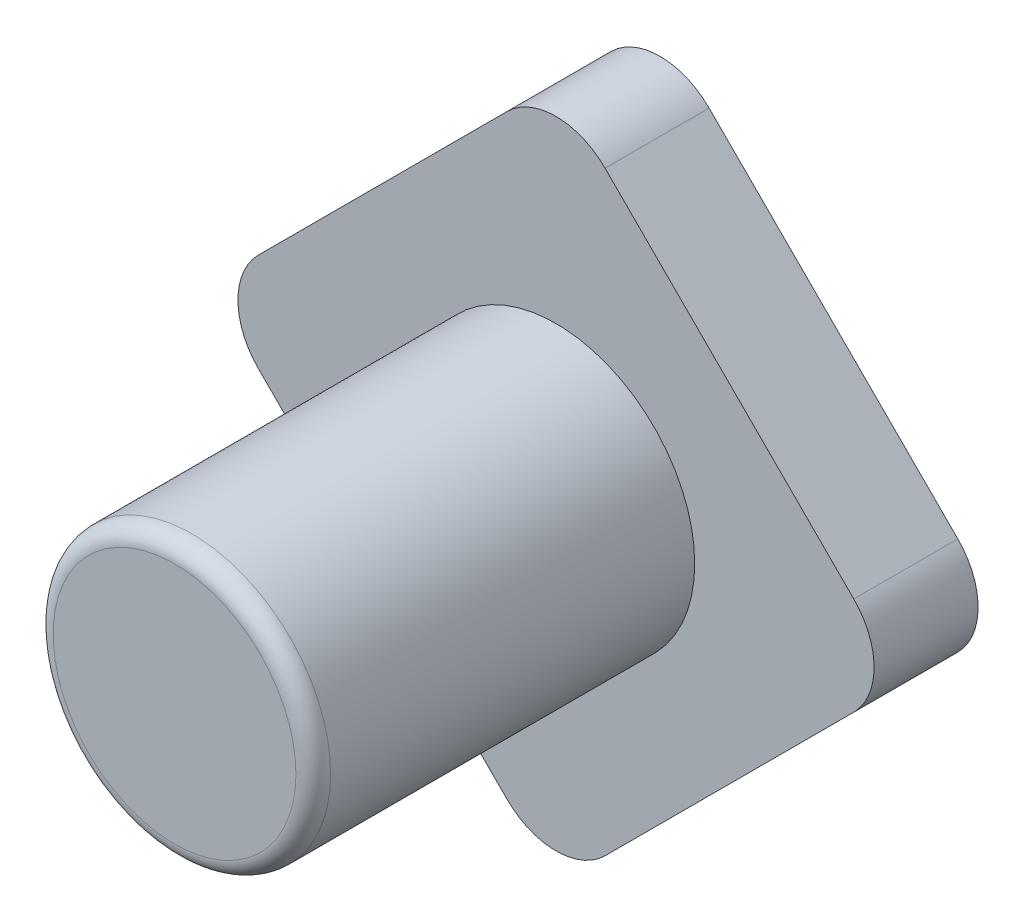
ISO-10303-21;
HEADER;
FILE_DESCRIPTION(('STEP AP214'),'2;1');
FILE_NAME('part.step','',(''),(''),'','','');
FILE_SCHEMA(('AUTOMOTIVE_DESIGN { 1 0 10303 214 1 1 1 1 }'));
ENDSEC;
DATA;
#1=APPLICATION_CONTEXT('core data for automotive mechanical design processes');
#2=APPLICATION_PROTOCOL_DEFINITION('international standard','automotive_design',2000,#1);
#3=PRODUCT_CONTEXT('',#1,'mechanical');
#4=PRODUCT('Part','Part','',(#3));
#5=PRODUCT_RELATED_PRODUCT_CATEGORY('part','',(#4));
#6=PRODUCT_DEFINITION_FORMATION('','',#4);
#7=PRODUCT_DEFINITION_CONTEXT('part definition',#1,'design');
#8=PRODUCT_DEFINITION('design','',#6,#7);
#9=PRODUCT_DEFINITION_SHAPE('','',#8);
#10=(LENGTH_UNIT() NAMED_UNIT(*) SI_UNIT(.MILLI.,.METRE.));
#11=(NAMED_UNIT(*) PLANE_ANGLE_UNIT() SI_UNIT($,.RADIAN.));
#12=(NAMED_UNIT(*) SI_UNIT($,.STERADIAN.) SOLID_ANGLE_UNIT());
#13=UNCERTAINTY_MEASURE_WITH_UNIT(LENGTH_MEASURE(1.E-05),#10,'distance_accuracy_value','');
#14=(GEOMETRIC_REPRESENTATION_CONTEXT(3) GLOBAL_UNCERTAINTY_ASSIGNED_CONTEXT((#13)) GLOBAL_UNIT_ASSIGNED_CONTEXT((#10,
#11,#12)) REPRESENTATION_CONTEXT('',''));
#15=CARTESIAN_POINT('',(0.,0.,0.));
#16=DIRECTION('',(0.,0.,1.));
#17=DIRECTION('',(1.,0.,0.));
#18=AXIS2_PLACEMENT_3D('',#15,#16,#17);
#19=CARTESIAN_POINT('',(-9.99999999999999,0.,-3.));
#20=DIRECTION('',(-0.707106781186548,0.707106781186547,0.));
#21=DIRECTION('',(-0.707106781186547,-0.707106781186548,0.));
#22=AXIS2_PLACEMENT_3D('',#19,#20,#21);
#23=PLANE('',#22);
#24=DIRECTION('',(-0.707106781186547,-0.707106781186548,0.));
#25=VECTOR('',#24,1.);
#26=CARTESIAN_POINT('',(-9.99999999999999,0.,-3.));
#27=LINE('',#26,#25);
#28=CARTESIAN_POINT('',(-1.4142135623731,8.5857864376269,-3.));
#29=VERTEX_POINT('',#28);
#30=CARTESIAN_POINT('',(-8.5857864376269,1.41421356237309,-3.));
#31=VERTEX_POINT('',#30);
#32=EDGE_CURVE('E299',#29,#31,#27,.T.);
#33=ORIENTED_EDGE('',*,*,#32,.T.);
#34=DIRECTION('',(0.,0.,1.));
#35=VECTOR('',#34,1.);
#36=CARTESIAN_POINT('',(-8.5857864376269,1.41421356237309,-3.));
#37=LINE('',#36,#35);
#38=CARTESIAN_POINT('',(-8.5857864376269,1.41421356237309,0.));
#39=VERTEX_POINT('',#38);
#40=EDGE_CURVE('E165',#31,#39,#37,.T.);
#41=ORIENTED_EDGE('',*,*,#40,.T.);
#42=DIRECTION('',(-0.707106781186547,-0.707106781186548,0.));
#43=VECTOR('',#42,1.);
#44=CARTESIAN_POINT('',(-9.99999999999999,0.,0.));
#45=LINE('',#44,#43);
#46=CARTESIAN_POINT('',(-1.4142135623731,8.5857864376269,0.));
#47=VERTEX_POINT('',#46);
#48=EDGE_CURVE('E113',#47,#39,#45,.T.);
#49=ORIENTED_EDGE('',*,*,#48,.F.);
#50=DIRECTION('',(0.,0.,1.));
#51=VECTOR('',#50,1.);
#52=CARTESIAN_POINT('',(-1.4142135623731,8.5857864376269,-3.));
#53=LINE('',#52,#51);
#54=EDGE_CURVE('E163',#47,#29,#53,.F.);
#55=ORIENTED_EDGE('',*,*,#54,.T.);
#56=EDGE_LOOP('',(#33,#41,#49,#55));
#57=FACE_BOUND('',#56,.T.);
#58=ADVANCED_FACE('F41',(#57),#23,.T.);
#59=CARTESIAN_POINT('',(0.,10.,-3.));
#60=DIRECTION('',(0.707106781186547,0.707106781186548,0.));
#61=DIRECTION('',(-0.707106781186548,0.707106781186547,0.));
#62=AXIS2_PLACEMENT_3D('',#59,#60,#61);
#63=PLANE('',#62);
#64=DIRECTION('',(-0.707106781186548,0.707106781186547,0.));
#65=VECTOR('',#64,1.);
#66=CARTESIAN_POINT('',(0.,10.,0.));
#67=LINE('',#66,#65);
#68=CARTESIAN_POINT('',(8.58578643762691,1.41421356237309,0.));
#69=VERTEX_POINT('',#68);
#70=CARTESIAN_POINT('',(1.4142135623731,8.5857864376269,0.));
#71=VERTEX_POINT('',#70);
#72=EDGE_CURVE('E141',#69,#71,#67,.T.);
#73=ORIENTED_EDGE('',*,*,#72,.F.);
#74=DIRECTION('',(0.,0.,1.));
#75=VECTOR('',#74,1.);
#76=CARTESIAN_POINT('',(8.58578643762691,1.4142135623731,-3.));
#77=LINE('',#76,#75);
#78=CARTESIAN_POINT('',(8.58578643762691,1.41421356237309,-3.));
#79=VERTEX_POINT('',#78);
#80=EDGE_CURVE('E63',#69,#79,#77,.F.);
#81=ORIENTED_EDGE('',*,*,#80,.T.);
#82=DIRECTION('',(-0.707106781186548,0.707106781186547,0.));
#83=VECTOR('',#82,1.);
#84=CARTESIAN_POINT('',(0.,10.,-3.));
#85=LINE('',#84,#83);
#86=CARTESIAN_POINT('',(1.4142135623731,8.5857864376269,-3.));
#87=VERTEX_POINT('',#86);
#88=EDGE_CURVE('E138',#79,#87,#85,.T.);
#89=ORIENTED_EDGE('',*,*,#88,.T.);
#90=DIRECTION('',(0.,0.,1.));
#91=VECTOR('',#90,1.);
#92=CARTESIAN_POINT('',(1.4142135623731,8.5857864376269,-3.));
#93=LINE('',#92,#91);
#94=EDGE_CURVE('E159',#87,#71,#93,.T.);
#95=ORIENTED_EDGE('',*,*,#94,.T.);
#96=EDGE_LOOP('',(#73,#81,#89,#95));
#97=FACE_BOUND('',#96,.T.);
#98=ADVANCED_FACE('F181',(#97),#63,.T.);
#99=CARTESIAN_POINT('',(10.,0.,-3.));
#100=DIRECTION('',(0.707106781186547,-0.707106781186548,0.));
#101=DIRECTION('',(0.707106781186548,0.707106781186547,0.));
#102=AXIS2_PLACEMENT_3D('',#99,#100,#101);
#103=PLANE('',#102);
#104=DIRECTION('',(0.707106781186548,0.707106781186547,0.));
#105=VECTOR('',#104,1.);
#106=CARTESIAN_POINT('',(10.,0.,0.));
#107=LINE('',#106,#105);
#108=CARTESIAN_POINT('',(1.4142135623731,-8.5857864376269,0.));
#109=VERTEX_POINT('',#108);
#110=CARTESIAN_POINT('',(8.58578643762691,-1.4142135623731,0.));
#111=VERTEX_POINT('',#110);
#112=EDGE_CURVE('E129',#109,#111,#107,.T.);
#113=ORIENTED_EDGE('',*,*,#112,.F.);
#114=DIRECTION('',(0.,0.,1.));
#115=VECTOR('',#114,1.);
#116=CARTESIAN_POINT('',(1.4142135623731,-8.5857864376269,-3.));
#117=LINE('',#116,#115);
#118=CARTESIAN_POINT('',(1.4142135623731,-8.5857864376269,-3.));
#119=VERTEX_POINT('',#118);
#120=EDGE_CURVE('E151',#109,#119,#117,.F.);
#121=ORIENTED_EDGE('',*,*,#120,.T.);
#122=DIRECTION('',(0.707106781186548,0.707106781186547,0.));
#123=VECTOR('',#122,1.);
#124=CARTESIAN_POINT('',(10.,0.,-3.));
#125=LINE('',#124,#123);
#126=CARTESIAN_POINT('',(8.58578643762691,-1.4142135623731,-3.));
#127=VERTEX_POINT('',#126);
#128=EDGE_CURVE('E298',#119,#127,#125,.T.);
#129=ORIENTED_EDGE('',*,*,#128,.T.);
#130=DIRECTION('',(0.,0.,1.));
#131=VECTOR('',#130,1.);
#132=CARTESIAN_POINT('',(8.58578643762691,-1.4142135623731,-3.));
#133=LINE('',#132,#131);
#134=EDGE_CURVE('E148',#127,#111,#133,.T.);
#135=ORIENTED_EDGE('',*,*,#134,.T.);
#136=EDGE_LOOP('',(#113,#121,#129,#135));
#137=FACE_BOUND('',#136,.T.);
#138=ADVANCED_FACE('F187',(#137),#103,.T.);
#139=CARTESIAN_POINT('',(0.,-10.,-3.));
#140=DIRECTION('',(-0.707106781186548,-0.707106781186547,0.));
#141=DIRECTION('',(0.707106781186547,-0.707106781186548,0.));
#142=AXIS2_PLACEMENT_3D('',#139,#140,#141);
#143=PLANE('',#142);
#144=DIRECTION('',(0.707106781186547,-0.707106781186548,0.));
#145=VECTOR('',#144,1.);
#146=CARTESIAN_POINT('',(0.,-10.,-3.));
#147=LINE('',#146,#145);
#148=CARTESIAN_POINT('',(-8.5857864376269,-1.41421356237309,-3.));
#149=VERTEX_POINT('',#148);
#150=CARTESIAN_POINT('',(-1.4142135623731,-8.5857864376269,-3.));
#151=VERTEX_POINT('',#150);
#152=EDGE_CURVE('E297',#149,#151,#147,.T.);
#153=ORIENTED_EDGE('',*,*,#152,.T.);
#154=DIRECTION('',(0.,0.,1.));
#155=VECTOR('',#154,1.);
#156=CARTESIAN_POINT('',(-1.4142135623731,-8.5857864376269,-3.));
#157=LINE('',#156,#155);
#158=CARTESIAN_POINT('',(-1.4142135623731,-8.5857864376269,0.));
#159=VERTEX_POINT('',#158);
#160=EDGE_CURVE('E128',#151,#159,#157,.T.);
#161=ORIENTED_EDGE('',*,*,#160,.T.);
#162=DIRECTION('',(0.707106781186547,-0.707106781186548,0.));
#163=VECTOR('',#162,1.);
#164=CARTESIAN_POINT('',(0.,-10.,0.));
#165=LINE('',#164,#163);
#166=CARTESIAN_POINT('',(-8.5857864376269,-1.41421356237309,0.));
#167=VERTEX_POINT('',#166);
#168=EDGE_CURVE('E111',#167,#159,#165,.T.);
#169=ORIENTED_EDGE('',*,*,#168,.F.);
#170=DIRECTION('',(0.,0.,1.));
#171=VECTOR('',#170,1.);
#172=CARTESIAN_POINT('',(-8.5857864376269,-1.4142135623731,-3.));
#173=LINE('',#172,#171);
#174=EDGE_CURVE('E125',#167,#149,#173,.F.);
#175=ORIENTED_EDGE('',*,*,#174,.T.);
#176=EDGE_LOOP('',(#153,#161,#169,#175));
#177=FACE_BOUND('',#176,.T.);
#178=ADVANCED_FACE('F124',(#177),#143,.T.);
#179=CARTESIAN_POINT('',(0.,0.,-3.));
#180=DIRECTION('',(0.,0.,-1.));
#181=DIRECTION('',(-1.,0.,0.));
#182=AXIS2_PLACEMENT_3D('',#179,#180,#181);
#183=PLANE('',#182);
#184=ORIENTED_EDGE('',*,*,#128,.F.);
#185=CARTESIAN_POINT('',(0.,-7.17157287525381,-3.));
#186=DIRECTION('',(0.,0.,-1.));
#187=DIRECTION('',(-1.,0.,0.));
#188=AXIS2_PLACEMENT_3D('',#185,#186,#187);
#189=CIRCLE('',#188,2.);
#190=EDGE_CURVE('E157',#119,#151,#189,.T.);
#191=ORIENTED_EDGE('',*,*,#190,.T.);
#192=ORIENTED_EDGE('',*,*,#152,.F.);
#193=CARTESIAN_POINT('',(-7.17157287525381,0.,-3.));
#194=DIRECTION('',(0.,0.,-1.));
#195=DIRECTION('',(-1.,0.,0.));
#196=AXIS2_PLACEMENT_3D('',#193,#194,#195);
#197=CIRCLE('',#196,2.);
#198=EDGE_CURVE('E133',#149,#31,#197,.T.);
#199=ORIENTED_EDGE('',*,*,#198,.T.);
#200=ORIENTED_EDGE('',*,*,#32,.F.);
#201=CARTESIAN_POINT('',(0.,7.17157287525381,-3.));
#202=DIRECTION('',(0.,0.,-1.));
#203=DIRECTION('',(-1.,0.,0.));
#204=AXIS2_PLACEMENT_3D('',#201,#202,#203);
#205=CIRCLE('',#204,2.);
#206=EDGE_CURVE('E56',#29,#87,#205,.T.);
#207=ORIENTED_EDGE('',*,*,#206,.T.);
#208=ORIENTED_EDGE('',*,*,#88,.F.);
#209=CARTESIAN_POINT('',(7.17157287525381,0.,-3.));
#210=DIRECTION('',(0.,0.,-1.));
#211=DIRECTION('',(-1.,0.,0.));
#212=AXIS2_PLACEMENT_3D('',#209,#210,#211);
#213=CIRCLE('',#212,2.);
#214=EDGE_CURVE('E155',#79,#127,#213,.T.);
#215=ORIENTED_EDGE('',*,*,#214,.T.);
#216=EDGE_LOOP('',(#184,#191,#192,#199,#200,#207,#208,#215));
#217=FACE_BOUND('',#216,.T.);
#218=ADVANCED_FACE('F250',(#217),#183,.T.);
#219=CARTESIAN_POINT('',(0.,0.,0.));
#220=DIRECTION('',(0.,0.,-1.));
#221=DIRECTION('',(-1.,0.,0.));
#222=AXIS2_PLACEMENT_3D('',#219,#220,#221);
#223=PLANE('',#222);
#224=CARTESIAN_POINT('',(0.,0.,0.));
#225=DIRECTION('',(0.,0.,1.));
#226=DIRECTION('',(1.,0.,0.));
#227=AXIS2_PLACEMENT_3D('',#224,#225,#226);
#228=CIRCLE('',#227,4.);
#229=CARTESIAN_POINT('',(4.,0.,0.));
#230=VERTEX_POINT('',#229);
#231=EDGE_CURVE('E134',#230,#230,#228,.T.);
#232=ORIENTED_EDGE('',*,*,#231,.F.);
#233=EDGE_LOOP('',(#232));
#234=FACE_BOUND('',#233,.T.);
#235=ORIENTED_EDGE('',*,*,#168,.T.);
#236=CARTESIAN_POINT('',(0.,-7.17157287525381,0.));
#237=DIRECTION('',(0.,0.,-1.));
#238=DIRECTION('',(-1.,0.,0.));
#239=AXIS2_PLACEMENT_3D('',#236,#237,#238);
#240=CIRCLE('',#239,2.);
#241=EDGE_CURVE('E146',#159,#109,#240,.F.);
#242=ORIENTED_EDGE('',*,*,#241,.T.);
#243=ORIENTED_EDGE('',*,*,#112,.T.);
#244=CARTESIAN_POINT('',(7.17157287525381,0.,0.));
#245=DIRECTION('',(0.,0.,-1.));
#246=DIRECTION('',(-1.,0.,0.));
#247=AXIS2_PLACEMENT_3D('',#244,#245,#246);
#248=CIRCLE('',#247,2.);
#249=EDGE_CURVE('E118',#111,#69,#248,.F.);
#250=ORIENTED_EDGE('',*,*,#249,.T.);
#251=ORIENTED_EDGE('',*,*,#72,.T.);
#252=CARTESIAN_POINT('',(0.,7.17157287525381,0.));
#253=DIRECTION('',(0.,0.,-1.));
#254=DIRECTION('',(-1.,0.,0.));
#255=AXIS2_PLACEMENT_3D('',#252,#253,#254);
#256=CIRCLE('',#255,2.);
#257=EDGE_CURVE('E119',#71,#47,#256,.F.);
#258=ORIENTED_EDGE('',*,*,#257,.T.);
#259=ORIENTED_EDGE('',*,*,#48,.T.);
#260=CARTESIAN_POINT('',(-7.17157287525381,0.,0.));
#261=DIRECTION('',(0.,0.,-1.));
#262=DIRECTION('',(-1.,0.,0.));
#263=AXIS2_PLACEMENT_3D('',#260,#261,#262);
#264=CIRCLE('',#263,2.);
#265=EDGE_CURVE('E108',#39,#167,#264,.F.);
#266=ORIENTED_EDGE('',*,*,#265,.T.);
#267=EDGE_LOOP('',(#235,#242,#243,#250,#251,#258,#259,#266));
#268=FACE_BOUND('',#267,.T.);
#269=ADVANCED_FACE('F110',(#234,#268),#223,.F.);
#270=CARTESIAN_POINT('',(0.,0.,11.));
#271=DIRECTION('',(0.,0.,-1.));
#272=DIRECTION('',(-1.,0.,0.));
#273=AXIS2_PLACEMENT_3D('',#270,#271,#272);
#274=CYLINDRICAL_SURFACE('',#273,4.);
#275=CARTESIAN_POINT('',(0.,0.,10.5));
#276=DIRECTION('',(0.,0.,1.));
#277=DIRECTION('',(1.,0.,0.));
#278=AXIS2_PLACEMENT_3D('',#275,#276,#277);
#279=CIRCLE('',#278,4.);
#280=CARTESIAN_POINT('',(4.,0.,10.5));
#281=VERTEX_POINT('',#280);
#282=EDGE_CURVE('E11',#281,#281,#279,.F.);
#283=ORIENTED_EDGE('',*,*,#282,.T.);
#284=EDGE_LOOP('',(#283));
#285=FACE_BOUND('',#284,.T.);
#286=ORIENTED_EDGE('',*,*,#231,.T.);
#287=EDGE_LOOP('',(#286));
#288=FACE_BOUND('',#287,.T.);
#289=ADVANCED_FACE('F215',(#285,#288),#274,.T.);
#290=CARTESIAN_POINT('',(0.,0.,11.));
#291=DIRECTION('',(0.,0.,1.));
#292=DIRECTION('',(1.,0.,0.));
#293=AXIS2_PLACEMENT_3D('',#290,#291,#292);
#294=PLANE('',#293);
#295=CARTESIAN_POINT('',(0.,0.,11.));
#296=DIRECTION('',(0.,0.,1.));
#297=DIRECTION('',(1.,0.,0.));
#298=AXIS2_PLACEMENT_3D('',#295,#296,#297);
#299=CIRCLE('',#298,3.5);
#300=CARTESIAN_POINT('',(3.5,0.,11.));
#301=VERTEX_POINT('',#300);
#302=EDGE_CURVE('E49',#301,#301,#299,.T.);
#303=ORIENTED_EDGE('',*,*,#302,.T.);
#304=EDGE_LOOP('',(#303));
#305=FACE_BOUND('',#304,.T.);
#306=ADVANCED_FACE('F169',(#305),#294,.T.);
#307=CARTESIAN_POINT('',(0.,-7.17157287525381,-3.));
#308=DIRECTION('',(0.,0.,1.));
#309=DIRECTION('',(1.,0.,0.));
#310=AXIS2_PLACEMENT_3D('',#307,#308,#309);
#311=CYLINDRICAL_SURFACE('',#310,2.);
#312=ORIENTED_EDGE('',*,*,#190,.F.);
#313=ORIENTED_EDGE('',*,*,#120,.F.);
#314=ORIENTED_EDGE('',*,*,#241,.F.);
#315=ORIENTED_EDGE('',*,*,#160,.F.);
#316=EDGE_LOOP('',(#312,#313,#314,#315));
#317=FACE_BOUND('',#316,.T.);
#318=ADVANCED_FACE('F193',(#317),#311,.T.);
#319=CARTESIAN_POINT('',(7.17157287525381,0.,-3.));
#320=DIRECTION('',(0.,0.,1.));
#321=DIRECTION('',(1.,0.,0.));
#322=AXIS2_PLACEMENT_3D('',#319,#320,#321);
#323=CYLINDRICAL_SURFACE('',#322,2.);
#324=ORIENTED_EDGE('',*,*,#214,.F.);
#325=ORIENTED_EDGE('',*,*,#80,.F.);
#326=ORIENTED_EDGE('',*,*,#249,.F.);
#327=ORIENTED_EDGE('',*,*,#134,.F.);
#328=EDGE_LOOP('',(#324,#325,#326,#327));
#329=FACE_BOUND('',#328,.T.);
#330=ADVANCED_FACE('F196',(#329),#323,.T.);
#331=CARTESIAN_POINT('',(-7.17157287525381,0.,-3.));
#332=DIRECTION('',(0.,0.,1.));
#333=DIRECTION('',(1.,0.,0.));
#334=AXIS2_PLACEMENT_3D('',#331,#332,#333);
#335=CYLINDRICAL_SURFACE('',#334,2.);
#336=ORIENTED_EDGE('',*,*,#198,.F.);
#337=ORIENTED_EDGE('',*,*,#174,.F.);
#338=ORIENTED_EDGE('',*,*,#265,.F.);
#339=ORIENTED_EDGE('',*,*,#40,.F.);
#340=EDGE_LOOP('',(#336,#337,#338,#339));
#341=FACE_BOUND('',#340,.T.);
#342=ADVANCED_FACE('F132',(#341),#335,.T.);
#343=CARTESIAN_POINT('',(0.,7.17157287525381,-3.));
#344=DIRECTION('',(0.,0.,1.));
#345=DIRECTION('',(1.,0.,0.));
#346=AXIS2_PLACEMENT_3D('',#343,#344,#345);
#347=CYLINDRICAL_SURFACE('',#346,2.);
#348=ORIENTED_EDGE('',*,*,#206,.F.);
#349=ORIENTED_EDGE('',*,*,#54,.F.);
#350=ORIENTED_EDGE('',*,*,#257,.F.);
#351=ORIENTED_EDGE('',*,*,#94,.F.);
#352=EDGE_LOOP('',(#348,#349,#350,#351));
#353=FACE_BOUND('',#352,.T.);
#354=ADVANCED_FACE('F172',(#353),#347,.T.);
#355=CARTESIAN_POINT('',(0.,0.,10.5));
#356=DIRECTION('',(0.,0.,1.));
#357=DIRECTION('',(1.,0.,0.));
#358=AXIS2_PLACEMENT_3D('',#355,#356,#357);
#359=TOROIDAL_SURFACE('',#358,3.5,0.5);
#360=ORIENTED_EDGE('',*,*,#282,.F.);
#361=EDGE_LOOP('',(#360));
#362=FACE_BOUND('',#361,.T.);
#363=ORIENTED_EDGE('',*,*,#302,.F.);
#364=EDGE_LOOP('',(#363));
#365=FACE_BOUND('',#364,.T.);
#366=ADVANCED_FACE('F43',(#362,#365),#359,.T.);
#367=CLOSED_SHELL('',(#58,#98,#138,#178,#218,#269,#289,#306,#318,#330,#342,#354,#366));
#368=MANIFOLD_SOLID_BREP('B2',#367);
#369=ADVANCED_BREP_SHAPE_REPRESENTATION('',(#18,#368),#14);
#370=SHAPE_DEFINITION_REPRESENTATION(#9,#369);
ENDSEC;
END-ISO-10303-21;
